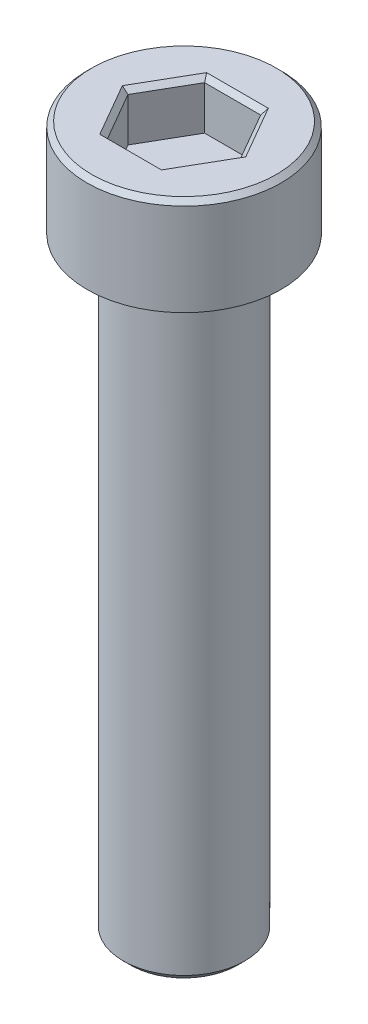
ISO-10303-21;
HEADER;
FILE_DESCRIPTION(('STEP AP214'),'2;1');
FILE_NAME('part.step','',(''),(''),'','','');
FILE_SCHEMA(('AUTOMOTIVE_DESIGN { 1 0 10303 214 1 1 1 1 }'));
ENDSEC;
DATA;
#1=APPLICATION_CONTEXT('core data for automotive mechanical design processes');
#2=APPLICATION_PROTOCOL_DEFINITION('international standard','automotive_design',2000,#1);
#3=PRODUCT_CONTEXT('',#1,'mechanical');
#4=PRODUCT('Part','Part','',(#3));
#5=PRODUCT_RELATED_PRODUCT_CATEGORY('part','',(#4));
#6=PRODUCT_DEFINITION_FORMATION('','',#4);
#7=PRODUCT_DEFINITION_CONTEXT('part definition',#1,'design');
#8=PRODUCT_DEFINITION('design','',#6,#7);
#9=PRODUCT_DEFINITION_SHAPE('','',#8);
#10=(LENGTH_UNIT() NAMED_UNIT(*) SI_UNIT(.MILLI.,.METRE.));
#11=(NAMED_UNIT(*) PLANE_ANGLE_UNIT() SI_UNIT($,.RADIAN.));
#12=(NAMED_UNIT(*) SI_UNIT($,.STERADIAN.) SOLID_ANGLE_UNIT());
#13=UNCERTAINTY_MEASURE_WITH_UNIT(LENGTH_MEASURE(1.E-05),#10,'distance_accuracy_value','');
#14=(GEOMETRIC_REPRESENTATION_CONTEXT(3) GLOBAL_UNCERTAINTY_ASSIGNED_CONTEXT((#13)) GLOBAL_UNIT_ASSIGNED_CONTEXT((#10,
#11,#12)) REPRESENTATION_CONTEXT('',''));
#15=CARTESIAN_POINT('',(0.,0.,0.));
#16=DIRECTION('',(0.,0.,1.));
#17=DIRECTION('',(1.,0.,0.));
#18=AXIS2_PLACEMENT_3D('',#15,#16,#17);
#19=CARTESIAN_POINT('',(0.,4.,0.));
#20=DIRECTION('',(0.,-1.,0.));
#21=DIRECTION('',(0.,0.,-1.));
#22=AXIS2_PLACEMENT_3D('',#19,#20,#21);
#23=CYLINDRICAL_SURFACE('',#22,4.);
#24=CARTESIAN_POINT('',(0.,3.8,0.));
#25=DIRECTION('',(0.,1.,0.));
#26=DIRECTION('',(0.,0.,1.));
#27=AXIS2_PLACEMENT_3D('',#24,#25,#26);
#28=CIRCLE('',#27,4.);
#29=CARTESIAN_POINT('',(0.,3.8,4.));
#30=VERTEX_POINT('',#29);
#31=EDGE_CURVE('E179',#30,#30,#28,.F.);
#32=ORIENTED_EDGE('',*,*,#31,.T.);
#33=EDGE_LOOP('',(#32));
#34=FACE_BOUND('',#33,.T.);
#35=CARTESIAN_POINT('',(0.,0.,0.));
#36=DIRECTION('',(0.,1.,0.));
#37=DIRECTION('',(0.,0.,1.));
#38=AXIS2_PLACEMENT_3D('',#35,#36,#37);
#39=CIRCLE('',#38,4.);
#40=CARTESIAN_POINT('',(0.,0.,4.));
#41=VERTEX_POINT('',#40);
#42=EDGE_CURVE('E149',#41,#41,#39,.T.);
#43=ORIENTED_EDGE('',*,*,#42,.T.);
#44=EDGE_LOOP('',(#43));
#45=FACE_BOUND('',#44,.T.);
#46=ADVANCED_FACE('F36',(#34,#45),#23,.T.);
#47=CARTESIAN_POINT('',(0.,4.,0.));
#48=DIRECTION('',(0.,1.,0.));
#49=DIRECTION('',(0.,0.,1.));
#50=AXIS2_PLACEMENT_3D('',#47,#48,#49);
#51=PLANE('',#50);
#52=CARTESIAN_POINT('',(0.,4.,0.));
#53=DIRECTION('',(0.,1.,0.));
#54=DIRECTION('',(0.,0.,1.));
#55=AXIS2_PLACEMENT_3D('',#52,#53,#54);
#56=CIRCLE('',#55,3.8);
#57=CARTESIAN_POINT('',(0.,4.,3.8));
#58=VERTEX_POINT('',#57);
#59=EDGE_CURVE('E176',#58,#58,#56,.T.);
#60=ORIENTED_EDGE('',*,*,#59,.T.);
#61=EDGE_LOOP('',(#60));
#62=FACE_BOUND('',#61,.T.);
#63=DIRECTION('',(0.500109828527989,0.,-0.865961984967992));
#64=VECTOR('',#63,1.);
#65=CARTESIAN_POINT('',(-1.32763927867956,4.,-2.10016839302008));
#66=LINE('',#65,#64);
#67=CARTESIAN_POINT('',(-2.54034116400461,4.,-0.000322175477219741));
#68=VERTEX_POINT('',#67);
#69=CARTESIAN_POINT('',(-1.26989156985456,4.,-2.20016107004593));
#70=VERTEX_POINT('',#69);
#71=EDGE_CURVE('E171',#68,#70,#66,.T.);
#72=ORIENTED_EDGE('',*,*,#71,.T.);
#73=DIRECTION('',(0.999999991957874,0.,0.00012682370352176));
#74=VECTOR('',#73,1.);
#75=CARTESIAN_POINT('',(1.15497954124075,4.,-2.19985353890859));
#76=LINE('',#75,#74);
#77=CARTESIAN_POINT('',(1.27044959415005,4.,-2.19983889456871));
#78=VERTEX_POINT('',#77);
#79=EDGE_CURVE('E173',#70,#78,#76,.T.);
#80=ORIENTED_EDGE('',*,*,#79,.T.);
#81=DIRECTION('',(0.499890163429886,0.,0.866088808671514));
#82=VECTOR('',#81,1.);
#83=CARTESIAN_POINT('',(2.48261881992031,4.,-0.0996851458885065));
#84=LINE('',#83,#82);
#85=CARTESIAN_POINT('',(2.54034116400461,4.,0.000322175477218117));
#86=VERTEX_POINT('',#85);
#87=EDGE_CURVE('E163',#78,#86,#84,.T.);
#88=ORIENTED_EDGE('',*,*,#87,.T.);
#89=DIRECTION('',(-0.500109828527989,0.,0.865961984967992));
#90=VECTOR('',#89,1.);
#91=CARTESIAN_POINT('',(1.32763927867956,4.,2.10016839302008));
#92=LINE('',#91,#90);
#93=CARTESIAN_POINT('',(1.26989156985456,4.,2.20016107004593));
#94=VERTEX_POINT('',#93);
#95=EDGE_CURVE('E165',#86,#94,#92,.T.);
#96=ORIENTED_EDGE('',*,*,#95,.T.);
#97=DIRECTION('',(-0.999999991957874,0.,-0.000126823703521948));
#98=VECTOR('',#97,1.);
#99=CARTESIAN_POINT('',(-1.15497954124075,4.,2.19985353890859));
#100=LINE('',#99,#98);
#101=CARTESIAN_POINT('',(-1.27044959415005,4.,2.19983889456871));
#102=VERTEX_POINT('',#101);
#103=EDGE_CURVE('E167',#94,#102,#100,.T.);
#104=ORIENTED_EDGE('',*,*,#103,.T.);
#105=DIRECTION('',(-0.499890163429885,0.,-0.866088808671514));
#106=VECTOR('',#105,1.);
#107=CARTESIAN_POINT('',(-2.48261881992031,4.,0.0996851458885052));
#108=LINE('',#107,#106);
#109=EDGE_CURVE('E169',#102,#68,#108,.T.);
#110=ORIENTED_EDGE('',*,*,#109,.T.);
#111=EDGE_LOOP('',(#72,#80,#88,#96,#104,#110));
#112=FACE_BOUND('',#111,.T.);
#113=ADVANCED_FACE('F218',(#62,#112),#51,.T.);
#114=CARTESIAN_POINT('',(0.,0.,0.));
#115=DIRECTION('',(0.,1.,0.));
#116=DIRECTION('',(0.,0.,1.));
#117=AXIS2_PLACEMENT_3D('',#114,#115,#116);
#118=PLANE('',#117);
#119=CARTESIAN_POINT('',(0.,0.,0.));
#120=DIRECTION('',(0.,1.,0.));
#121=DIRECTION('',(0.,0.,1.));
#122=AXIS2_PLACEMENT_3D('',#119,#120,#121);
#123=CIRCLE('',#122,2.5);
#124=CARTESIAN_POINT('',(0.,0.,2.5));
#125=VERTEX_POINT('',#124);
#126=EDGE_CURVE('E160',#125,#125,#123,.F.);
#127=ORIENTED_EDGE('',*,*,#126,.F.);
#128=EDGE_LOOP('',(#127));
#129=FACE_BOUND('',#128,.T.);
#130=ORIENTED_EDGE('',*,*,#42,.F.);
#131=EDGE_LOOP('',(#130));
#132=FACE_BOUND('',#131,.T.);
#133=ADVANCED_FACE('F224',(#129,#132),#118,.F.);
#134=CARTESIAN_POINT('',(0.,-25.,0.));
#135=DIRECTION('',(0.,1.,0.));
#136=DIRECTION('',(0.,0.,1.));
#137=AXIS2_PLACEMENT_3D('',#134,#135,#136);
#138=CYLINDRICAL_SURFACE('',#137,2.5);
#139=CARTESIAN_POINT('',(0.,-24.7,0.));
#140=DIRECTION('',(0.,-1.,0.));
#141=DIRECTION('',(0.,0.,-1.));
#142=AXIS2_PLACEMENT_3D('',#139,#140,#141);
#143=CIRCLE('',#142,2.5);
#144=CARTESIAN_POINT('',(0.,-24.7,-2.5));
#145=VERTEX_POINT('',#144);
#146=EDGE_CURVE('E11',#145,#145,#143,.F.);
#147=ORIENTED_EDGE('',*,*,#146,.T.);
#148=EDGE_LOOP('',(#147));
#149=FACE_BOUND('',#148,.T.);
#150=ORIENTED_EDGE('',*,*,#126,.T.);
#151=EDGE_LOOP('',(#150));
#152=FACE_BOUND('',#151,.T.);
#153=ADVANCED_FACE('F294',(#149,#152),#138,.T.);
#154=CARTESIAN_POINT('',(0.,-25.,0.));
#155=DIRECTION('',(0.,-1.,0.));
#156=DIRECTION('',(0.,0.,-1.));
#157=AXIS2_PLACEMENT_3D('',#154,#155,#156);
#158=PLANE('',#157);
#159=CARTESIAN_POINT('',(0.,-25.,0.));
#160=DIRECTION('',(0.,-1.,0.));
#161=DIRECTION('',(0.,0.,-1.));
#162=AXIS2_PLACEMENT_3D('',#159,#160,#161);
#163=CIRCLE('',#162,2.2);
#164=CARTESIAN_POINT('',(0.,-25.,-2.2));
#165=VERTEX_POINT('',#164);
#166=EDGE_CURVE('E44',#165,#165,#163,.T.);
#167=ORIENTED_EDGE('',*,*,#166,.T.);
#168=EDGE_LOOP('',(#167));
#169=FACE_BOUND('',#168,.T.);
#170=ADVANCED_FACE('F205',(#169),#158,.T.);
#171=CARTESIAN_POINT('',(2.30940105818601,2.,0.000292886797471428));
#172=DIRECTION('',(0.866088808671514,0.,-0.499890163429886));
#173=DIRECTION('',(-0.499890163429886,0.,-0.866088808671514));
#174=AXIS2_PLACEMENT_3D('',#171,#172,#173);
#175=PLANE('',#174);
#176=DIRECTION('',(0.,1.,0.));
#177=VECTOR('',#176,1.);
#178=CARTESIAN_POINT('',(2.30940105818601,2.,0.000292886797471428));
#179=LINE('',#178,#177);
#180=CARTESIAN_POINT('',(2.30940105818601,2.,0.000292886797471428));
#181=VERTEX_POINT('',#180);
#182=CARTESIAN_POINT('',(2.30940105818601,3.8,0.000292886797471428));
#183=VERTEX_POINT('',#182);
#184=EDGE_CURVE('E147',#181,#183,#179,.T.);
#185=ORIENTED_EDGE('',*,*,#184,.T.);
#186=DIRECTION('',(-0.499890163429886,0.,-0.866088808671514));
#187=VECTOR('',#186,1.);
#188=CARTESIAN_POINT('',(1.15495417650005,3.8,-1.99985354051701));
#189=LINE('',#188,#187);
#190=CARTESIAN_POINT('',(1.15495417650005,3.8,-1.99985354051701));
#191=VERTEX_POINT('',#190);
#192=EDGE_CURVE('E115',#183,#191,#189,.T.);
#193=ORIENTED_EDGE('',*,*,#192,.T.);
#194=DIRECTION('',(0.,1.,0.));
#195=VECTOR('',#194,1.);
#196=CARTESIAN_POINT('',(1.15495417650005,2.,-1.99985354051701));
#197=LINE('',#196,#195);
#198=CARTESIAN_POINT('',(1.15495417650005,2.,-1.99985354051701));
#199=VERTEX_POINT('',#198);
#200=EDGE_CURVE('E108',#199,#191,#197,.T.);
#201=ORIENTED_EDGE('',*,*,#200,.F.);
#202=DIRECTION('',(-0.499890163429885,0.,-0.866088808671514));
#203=VECTOR('',#202,1.);
#204=CARTESIAN_POINT('',(2.30940105818601,2.,0.000292886797471428));
#205=LINE('',#204,#203);
#206=EDGE_CURVE('E112',#181,#199,#205,.T.);
#207=ORIENTED_EDGE('',*,*,#206,.F.);
#208=EDGE_LOOP('',(#185,#193,#201,#207));
#209=FACE_BOUND('',#208,.T.);
#210=ADVANCED_FACE('F110',(#209),#175,.F.);
#211=CARTESIAN_POINT('',(1.15444688168596,2.,2.00014642731448));
#212=DIRECTION('',(0.865961984967992,0.,0.500109828527989));
#213=DIRECTION('',(0.500109828527989,0.,-0.865961984967992));
#214=AXIS2_PLACEMENT_3D('',#211,#212,#213);
#215=PLANE('',#214);
#216=DIRECTION('',(0.,1.,0.));
#217=VECTOR('',#216,1.);
#218=CARTESIAN_POINT('',(1.15444688168596,2.,2.00014642731448));
#219=LINE('',#218,#217);
#220=CARTESIAN_POINT('',(1.15444688168596,2.,2.00014642731448));
#221=VERTEX_POINT('',#220);
#222=CARTESIAN_POINT('',(1.15444688168596,3.8,2.00014642731448));
#223=VERTEX_POINT('',#222);
#224=EDGE_CURVE('E150',#221,#223,#219,.T.);
#225=ORIENTED_EDGE('',*,*,#224,.T.);
#226=DIRECTION('',(0.500109828527989,0.,-0.865961984967992));
#227=VECTOR('',#226,1.);
#228=CARTESIAN_POINT('',(2.30940105818601,3.8,0.000292886797471402));
#229=LINE('',#228,#227);
#230=EDGE_CURVE('E51',#223,#183,#229,.T.);
#231=ORIENTED_EDGE('',*,*,#230,.T.);
#232=ORIENTED_EDGE('',*,*,#184,.F.);
#233=DIRECTION('',(0.500109828527989,0.,-0.865961984967992));
#234=VECTOR('',#233,1.);
#235=CARTESIAN_POINT('',(1.15444688168596,2.,2.00014642731448));
#236=LINE('',#235,#234);
#237=EDGE_CURVE('E120',#221,#181,#236,.T.);
#238=ORIENTED_EDGE('',*,*,#237,.F.);
#239=EDGE_LOOP('',(#225,#231,#232,#238));
#240=FACE_BOUND('',#239,.T.);
#241=ADVANCED_FACE('F275',(#240),#215,.F.);
#242=CARTESIAN_POINT('',(-1.15495417650005,2.,1.99985354051701));
#243=DIRECTION('',(-0.000126823703521948,0.,0.999999991957874));
#244=DIRECTION('',(0.999999991957874,0.,0.000126823703521948));
#245=AXIS2_PLACEMENT_3D('',#242,#243,#244);
#246=PLANE('',#245);
#247=DIRECTION('',(0.,1.,0.));
#248=VECTOR('',#247,1.);
#249=CARTESIAN_POINT('',(-1.15495417650005,2.,1.99985354051701));
#250=LINE('',#249,#248);
#251=CARTESIAN_POINT('',(-1.15495417650005,2.,1.99985354051701));
#252=VERTEX_POINT('',#251);
#253=CARTESIAN_POINT('',(-1.15495417650005,3.8,1.99985354051701));
#254=VERTEX_POINT('',#253);
#255=EDGE_CURVE('E152',#252,#254,#250,.T.);
#256=ORIENTED_EDGE('',*,*,#255,.T.);
#257=DIRECTION('',(0.999999991957874,0.,0.000126823703521948));
#258=VECTOR('',#257,1.);
#259=CARTESIAN_POINT('',(1.15444688168596,3.8,2.00014642731448));
#260=LINE('',#259,#258);
#261=EDGE_CURVE('E59',#254,#223,#260,.T.);
#262=ORIENTED_EDGE('',*,*,#261,.T.);
#263=ORIENTED_EDGE('',*,*,#224,.F.);
#264=DIRECTION('',(0.999999991957874,0.,0.000126823703521948));
#265=VECTOR('',#264,1.);
#266=CARTESIAN_POINT('',(-1.15495417650005,2.,1.99985354051701));
#267=LINE('',#266,#265);
#268=EDGE_CURVE('E144',#252,#221,#267,.T.);
#269=ORIENTED_EDGE('',*,*,#268,.F.);
#270=EDGE_LOOP('',(#256,#262,#263,#269));
#271=FACE_BOUND('',#270,.T.);
#272=ADVANCED_FACE('F274',(#271),#246,.F.);
#273=CARTESIAN_POINT('',(-2.30940105818601,2.,-0.00029288679747257));
#274=DIRECTION('',(-0.866088808671514,0.,0.499890163429885));
#275=DIRECTION('',(0.499890163429885,0.,0.866088808671514));
#276=AXIS2_PLACEMENT_3D('',#273,#274,#275);
#277=PLANE('',#276);
#278=DIRECTION('',(0.,1.,0.));
#279=VECTOR('',#278,1.);
#280=CARTESIAN_POINT('',(-2.30940105818601,2.,-0.00029288679747257));
#281=LINE('',#280,#279);
#282=CARTESIAN_POINT('',(-2.30940105818601,2.,-0.00029288679747257));
#283=VERTEX_POINT('',#282);
#284=CARTESIAN_POINT('',(-2.30940105818601,3.8,-0.00029288679747257));
#285=VERTEX_POINT('',#284);
#286=EDGE_CURVE('E154',#283,#285,#281,.T.);
#287=ORIENTED_EDGE('',*,*,#286,.T.);
#288=DIRECTION('',(0.499890163429885,0.,0.866088808671514));
#289=VECTOR('',#288,1.);
#290=CARTESIAN_POINT('',(-1.15495417650005,3.8,1.99985354051701));
#291=LINE('',#290,#289);
#292=EDGE_CURVE('E186',#285,#254,#291,.T.);
#293=ORIENTED_EDGE('',*,*,#292,.T.);
#294=ORIENTED_EDGE('',*,*,#255,.F.);
#295=DIRECTION('',(0.499890163429885,0.,0.866088808671514));
#296=VECTOR('',#295,1.);
#297=CARTESIAN_POINT('',(-2.30940105818601,2.,-0.00029288679747257));
#298=LINE('',#297,#296);
#299=EDGE_CURVE('E141',#283,#252,#298,.T.);
#300=ORIENTED_EDGE('',*,*,#299,.F.);
#301=EDGE_LOOP('',(#287,#293,#294,#300));
#302=FACE_BOUND('',#301,.T.);
#303=ADVANCED_FACE('F273',(#302),#277,.F.);
#304=CARTESIAN_POINT('',(-1.15444688168596,2.,-2.00014642731448));
#305=DIRECTION('',(-0.865961984967992,0.,-0.500109828527989));
#306=DIRECTION('',(-0.500109828527989,0.,0.865961984967992));
#307=AXIS2_PLACEMENT_3D('',#304,#305,#306);
#308=PLANE('',#307);
#309=DIRECTION('',(0.,1.,0.));
#310=VECTOR('',#309,1.);
#311=CARTESIAN_POINT('',(-1.15444688168596,2.,-2.00014642731448));
#312=LINE('',#311,#310);
#313=CARTESIAN_POINT('',(-1.15444688168596,2.,-2.00014642731448));
#314=VERTEX_POINT('',#313);
#315=CARTESIAN_POINT('',(-1.15444688168596,3.8,-2.00014642731448));
#316=VERTEX_POINT('',#315);
#317=EDGE_CURVE('E119',#314,#316,#312,.T.);
#318=ORIENTED_EDGE('',*,*,#317,.T.);
#319=DIRECTION('',(-0.500109828527989,0.,0.865961984967992));
#320=VECTOR('',#319,1.);
#321=CARTESIAN_POINT('',(-2.30940105818601,3.8,-0.000292886797472594));
#322=LINE('',#321,#320);
#323=EDGE_CURVE('E184',#316,#285,#322,.T.);
#324=ORIENTED_EDGE('',*,*,#323,.T.);
#325=ORIENTED_EDGE('',*,*,#286,.F.);
#326=DIRECTION('',(-0.500109828527989,0.,0.865961984967992));
#327=VECTOR('',#326,1.);
#328=CARTESIAN_POINT('',(-1.15444688168596,2.,-2.00014642731448));
#329=LINE('',#328,#327);
#330=EDGE_CURVE('E129',#314,#283,#329,.T.);
#331=ORIENTED_EDGE('',*,*,#330,.F.);
#332=EDGE_LOOP('',(#318,#324,#325,#331));
#333=FACE_BOUND('',#332,.T.);
#334=ADVANCED_FACE('F269',(#333),#308,.F.);
#335=CARTESIAN_POINT('',(1.15495417650005,2.,-1.99985354051701));
#336=DIRECTION('',(0.00012682370352176,0.,-0.999999991957874));
#337=DIRECTION('',(-0.999999991957874,0.,-0.00012682370352176));
#338=AXIS2_PLACEMENT_3D('',#335,#336,#337);
#339=PLANE('',#338);
#340=ORIENTED_EDGE('',*,*,#200,.T.);
#341=DIRECTION('',(-0.999999991957874,0.,-0.00012682370352176));
#342=VECTOR('',#341,1.);
#343=CARTESIAN_POINT('',(-1.15444688168596,3.8,-2.00014642731448));
#344=LINE('',#343,#342);
#345=EDGE_CURVE('E182',#191,#316,#344,.T.);
#346=ORIENTED_EDGE('',*,*,#345,.T.);
#347=ORIENTED_EDGE('',*,*,#317,.F.);
#348=DIRECTION('',(-0.999999991957874,0.,-0.00012682370352176));
#349=VECTOR('',#348,1.);
#350=CARTESIAN_POINT('',(1.15495417650005,2.,-1.99985354051701));
#351=LINE('',#350,#349);
#352=EDGE_CURVE('E123',#199,#314,#351,.T.);
#353=ORIENTED_EDGE('',*,*,#352,.F.);
#354=EDGE_LOOP('',(#340,#346,#347,#353));
#355=FACE_BOUND('',#354,.T.);
#356=ADVANCED_FACE('F124',(#355),#339,.F.);
#357=CARTESIAN_POINT('',(0.,2.,0.));
#358=DIRECTION('',(0.,1.,0.));
#359=DIRECTION('',(0.,0.,1.));
#360=AXIS2_PLACEMENT_3D('',#357,#358,#359);
#361=PLANE('',#360);
#362=ORIENTED_EDGE('',*,*,#206,.T.);
#363=ORIENTED_EDGE('',*,*,#352,.T.);
#364=ORIENTED_EDGE('',*,*,#330,.T.);
#365=ORIENTED_EDGE('',*,*,#299,.T.);
#366=ORIENTED_EDGE('',*,*,#268,.T.);
#367=ORIENTED_EDGE('',*,*,#237,.T.);
#368=EDGE_LOOP('',(#362,#363,#364,#365,#366,#367));
#369=FACE_BOUND('',#368,.T.);
#370=ADVANCED_FACE('F131',(#369),#361,.T.);
#371=CARTESIAN_POINT('',(0.,4.,0.));
#372=DIRECTION('',(0.,-1.,0.));
#373=DIRECTION('',(0.,0.,-1.));
#374=AXIS2_PLACEMENT_3D('',#371,#372,#373);
#375=CONICAL_SURFACE('',#374,3.8,0.785398163397448);
#376=ORIENTED_EDGE('',*,*,#31,.F.);
#377=EDGE_LOOP('',(#376));
#378=FACE_BOUND('',#377,.T.);
#379=ORIENTED_EDGE('',*,*,#59,.F.);
#380=EDGE_LOOP('',(#379));
#381=FACE_BOUND('',#380,.T.);
#382=ADVANCED_FACE('F230',(#378,#381),#375,.T.);
#383=CARTESIAN_POINT('',(-1.15495417650005,3.8,1.99985354051701));
#384=DIRECTION('',(8.96779007755611E-05,0.707106781186551,-0.707106775499902));
#385=DIRECTION('',(-0.999999991957874,0.,-0.000126823703521948));
#386=AXIS2_PLACEMENT_3D('',#383,#384,#385);
#387=PLANE('',#386);
#388=DIRECTION('',(-0.378047495572636,0.654653670707973,0.654605730588906));
#389=VECTOR('',#388,1.);
#390=CARTESIAN_POINT('',(-0.824967268928602,3.22857142857143,1.42846681465501));
#391=LINE('',#390,#389);
#392=EDGE_CURVE('E137',#102,#254,#391,.F.);
#393=ORIENTED_EDGE('',*,*,#392,.F.);
#394=ORIENTED_EDGE('',*,*,#103,.F.);
#395=DIRECTION('',(0.377881444366549,0.654653670707973,0.654701600297439));
#396=VECTOR('',#395,1.);
#397=CARTESIAN_POINT('',(0.824604915489967,3.22857142857143,1.42867601951034));
#398=LINE('',#397,#396);
#399=EDGE_CURVE('E134',#223,#94,#398,.T.);
#400=ORIENTED_EDGE('',*,*,#399,.F.);
#401=ORIENTED_EDGE('',*,*,#261,.F.);
#402=EDGE_LOOP('',(#393,#394,#400,#401));
#403=FACE_BOUND('',#402,.T.);
#404=ADVANCED_FACE('F232',(#403),#387,.T.);
#405=CARTESIAN_POINT('',(1.15444688168596,3.8,2.00014642731448));
#406=DIRECTION('',(-0.612327591820627,0.707106781186552,-0.35363105109018));
#407=DIRECTION('',(-0.500109828527989,0.,0.865961984967992));
#408=AXIS2_PLACEMENT_3D('',#405,#406,#407);
#409=PLANE('',#408);
#410=ORIENTED_EDGE('',*,*,#399,.T.);
#411=ORIENTED_EDGE('',*,*,#95,.F.);
#412=DIRECTION('',(0.755928939939183,0.654653670707972,9.58697085317918E-05));
#413=VECTOR('',#412,1.);
#414=CARTESIAN_POINT('',(1.64957218441857,3.22857142857143,0.000209204855337701));
#415=LINE('',#414,#413);
#416=EDGE_CURVE('E198',#183,#86,#415,.T.);
#417=ORIENTED_EDGE('',*,*,#416,.F.);
#418=ORIENTED_EDGE('',*,*,#230,.F.);
#419=EDGE_LOOP('',(#410,#411,#417,#418));
#420=FACE_BOUND('',#419,.T.);
#421=ADVANCED_FACE('F245',(#420),#409,.T.);
#422=CARTESIAN_POINT('',(-2.30940105818601,3.8,-0.00029288679747257));
#423=DIRECTION('',(0.612417269721402,0.707106781186552,-0.353475724409721));
#424=DIRECTION('',(-0.499890163429885,0.,-0.866088808671514));
#425=AXIS2_PLACEMENT_3D('',#422,#423,#424);
#426=PLANE('',#425);
#427=ORIENTED_EDGE('',*,*,#392,.T.);
#428=ORIENTED_EDGE('',*,*,#292,.F.);
#429=DIRECTION('',(-0.755928939939183,0.654653670707973,-9.58697085322281E-05));
#430=VECTOR('',#429,1.);
#431=CARTESIAN_POINT('',(-1.64957218441857,3.22857142857143,-0.000209204855339002));
#432=LINE('',#431,#430);
#433=EDGE_CURVE('E195',#68,#285,#432,.F.);
#434=ORIENTED_EDGE('',*,*,#433,.F.);
#435=ORIENTED_EDGE('',*,*,#109,.F.);
#436=EDGE_LOOP('',(#427,#428,#434,#435));
#437=FACE_BOUND('',#436,.T.);
#438=ADVANCED_FACE('F241',(#437),#426,.T.);
#439=CARTESIAN_POINT('',(2.30940105818601,3.8,0.000292886797471428));
#440=DIRECTION('',(-0.612417269721401,0.707106781186553,0.353475724409721));
#441=DIRECTION('',(0.499890163429886,0.,0.866088808671514));
#442=AXIS2_PLACEMENT_3D('',#439,#440,#441);
#443=PLANE('',#442);
#444=ORIENTED_EDGE('',*,*,#416,.T.);
#445=ORIENTED_EDGE('',*,*,#87,.F.);
#446=DIRECTION('',(-0.378047495572635,-0.654653670707972,0.654605730588907));
#447=VECTOR('',#446,1.);
#448=CARTESIAN_POINT('',(1.15495417650005,3.8,-1.99985354051701));
#449=LINE('',#448,#447);
#450=EDGE_CURVE('E193',#191,#78,#449,.F.);
#451=ORIENTED_EDGE('',*,*,#450,.F.);
#452=ORIENTED_EDGE('',*,*,#192,.F.);
#453=EDGE_LOOP('',(#444,#445,#451,#452));
#454=FACE_BOUND('',#453,.T.);
#455=ADVANCED_FACE('F237',(#454),#443,.T.);
#456=CARTESIAN_POINT('',(-1.15444688168596,3.8,-2.00014642731448));
#457=DIRECTION('',(0.612327591820627,0.707106781186552,0.35363105109018));
#458=DIRECTION('',(0.500109828527989,0.,-0.865961984967992));
#459=AXIS2_PLACEMENT_3D('',#456,#457,#458);
#460=PLANE('',#459);
#461=ORIENTED_EDGE('',*,*,#433,.T.);
#462=ORIENTED_EDGE('',*,*,#323,.F.);
#463=DIRECTION('',(-0.377881444366547,0.654653670707972,-0.654701600297441));
#464=VECTOR('',#463,1.);
#465=CARTESIAN_POINT('',(-0.824604915489971,3.22857142857143,-1.42867601951034));
#466=LINE('',#465,#464);
#467=EDGE_CURVE('E191',#70,#316,#466,.F.);
#468=ORIENTED_EDGE('',*,*,#467,.F.);
#469=ORIENTED_EDGE('',*,*,#71,.F.);
#470=EDGE_LOOP('',(#461,#462,#468,#469));
#471=FACE_BOUND('',#470,.T.);
#472=ADVANCED_FACE('F213',(#471),#460,.T.);
#473=CARTESIAN_POINT('',(1.15495417650005,3.8,-1.99985354051701));
#474=DIRECTION('',(-8.96779007754282E-05,0.707106781186553,0.707106775499901));
#475=DIRECTION('',(0.999999991957874,0.,0.00012682370352176));
#476=AXIS2_PLACEMENT_3D('',#473,#474,#475);
#477=PLANE('',#476);
#478=ORIENTED_EDGE('',*,*,#450,.T.);
#479=ORIENTED_EDGE('',*,*,#79,.F.);
#480=ORIENTED_EDGE('',*,*,#467,.T.);
#481=ORIENTED_EDGE('',*,*,#345,.F.);
#482=EDGE_LOOP('',(#478,#479,#480,#481));
#483=FACE_BOUND('',#482,.T.);
#484=ADVANCED_FACE('F208',(#483),#477,.T.);
#485=CARTESIAN_POINT('',(0.,-25.,0.));
#486=DIRECTION('',(0.,1.,0.));
#487=DIRECTION('',(0.,0.,1.));
#488=AXIS2_PLACEMENT_3D('',#485,#486,#487);
#489=CONICAL_SURFACE('',#488,2.2,0.78539816339745);
#490=ORIENTED_EDGE('',*,*,#146,.F.);
#491=EDGE_LOOP('',(#490));
#492=FACE_BOUND('',#491,.T.);
#493=ORIENTED_EDGE('',*,*,#166,.F.);
#494=EDGE_LOOP('',(#493));
#495=FACE_BOUND('',#494,.T.);
#496=ADVANCED_FACE('F38',(#492,#495),#489,.T.);
#497=CLOSED_SHELL('',(#46,#113,#133,#153,#170,#210,#241,#272,#303,#334,#356,#370,#382,#404,#421,
#438,#455,#472,#484,#496));
#498=MANIFOLD_SOLID_BREP('B2',#497);
#499=ADVANCED_BREP_SHAPE_REPRESENTATION('',(#18,#498),#14);
#500=SHAPE_DEFINITION_REPRESENTATION(#9,#499);
ENDSEC;
END-ISO-10303-21;
